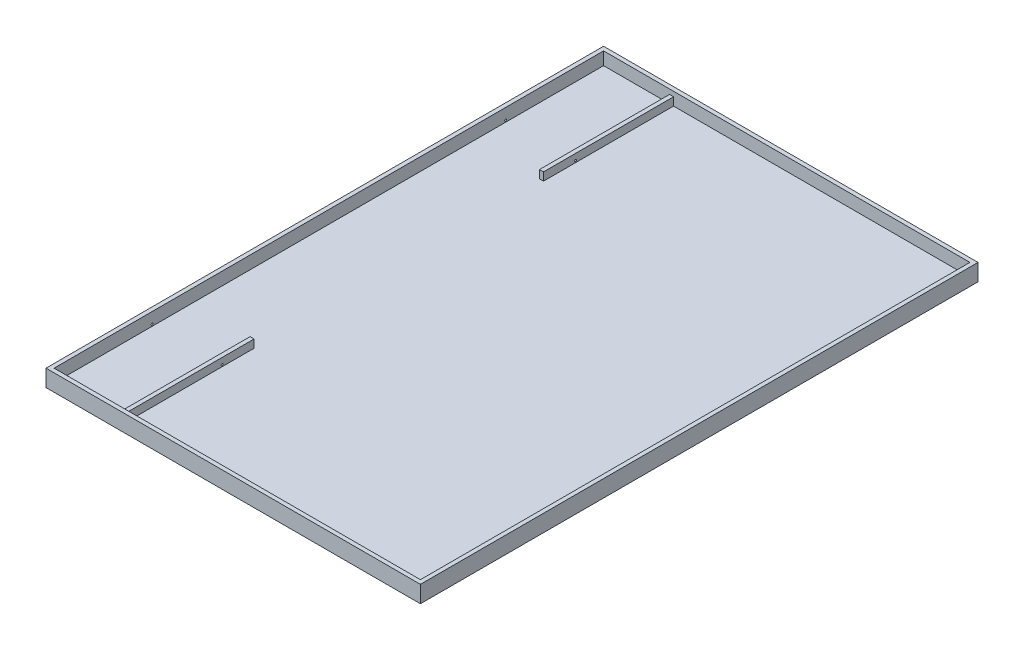
ISO-10303-21;
HEADER;
FILE_DESCRIPTION(('STEP AP214'),'2;1');
FILE_NAME('part.step','',(''),(''),'','','');
FILE_SCHEMA(('AUTOMOTIVE_DESIGN { 1 0 10303 214 1 1 1 1 }'));
ENDSEC;
DATA;
#1=APPLICATION_CONTEXT('core data for automotive mechanical design processes');
#2=APPLICATION_PROTOCOL_DEFINITION('international standard','automotive_design',2000,#1);
#3=PRODUCT_CONTEXT('',#1,'mechanical');
#4=PRODUCT('Part','Part','',(#3));
#5=PRODUCT_RELATED_PRODUCT_CATEGORY('part','',(#4));
#6=PRODUCT_DEFINITION_FORMATION('','',#4);
#7=PRODUCT_DEFINITION_CONTEXT('part definition',#1,'design');
#8=PRODUCT_DEFINITION('design','',#6,#7);
#9=PRODUCT_DEFINITION_SHAPE('','',#8);
#10=(LENGTH_UNIT() NAMED_UNIT(*) SI_UNIT(.MILLI.,.METRE.));
#11=(NAMED_UNIT(*) PLANE_ANGLE_UNIT() SI_UNIT($,.RADIAN.));
#12=(NAMED_UNIT(*) SI_UNIT($,.STERADIAN.) SOLID_ANGLE_UNIT());
#13=UNCERTAINTY_MEASURE_WITH_UNIT(LENGTH_MEASURE(1.E-05),#10,'distance_accuracy_value','');
#14=(GEOMETRIC_REPRESENTATION_CONTEXT(3) GLOBAL_UNCERTAINTY_ASSIGNED_CONTEXT((#13)) GLOBAL_UNIT_ASSIGNED_CONTEXT((#10,
#11,#12)) REPRESENTATION_CONTEXT('',''));
#15=CARTESIAN_POINT('',(0.,0.,0.));
#16=DIRECTION('',(0.,0.,1.));
#17=DIRECTION('',(1.,0.,0.));
#18=AXIS2_PLACEMENT_3D('',#15,#16,#17);
#19=CARTESIAN_POINT('',(1000.,-3688.58860522966,-1500.));
#20=DIRECTION('',(0.,0.,-1.));
#21=DIRECTION('',(-1.,0.,0.));
#22=AXIS2_PLACEMENT_3D('',#19,#20,#21);
#23=PLANE('',#22);
#24=DIRECTION('',(0.,-1.,0.));
#25=VECTOR('',#24,1.);
#26=CARTESIAN_POINT('',(-640.,44.,-1500.));
#27=LINE('',#26,#25);
#28=CARTESIAN_POINT('',(-640.,44.,-1500.));
#29=VERTEX_POINT('',#28);
#30=CARTESIAN_POINT('',(-640.,0.,-1500.));
#31=VERTEX_POINT('',#30);
#32=EDGE_CURVE('E199',#29,#31,#27,.T.);
#33=ORIENTED_EDGE('',*,*,#32,.F.);
#34=DIRECTION('',(-1.,0.,0.));
#35=VECTOR('',#34,1.);
#36=CARTESIAN_POINT('',(-640.,44.,-1500.));
#37=LINE('',#36,#35);
#38=CARTESIAN_POINT('',(-618.,44.,-1500.));
#39=VERTEX_POINT('',#38);
#40=EDGE_CURVE('E197',#39,#29,#37,.T.);
#41=ORIENTED_EDGE('',*,*,#40,.F.);
#42=DIRECTION('',(0.,-1.,0.));
#43=VECTOR('',#42,1.);
#44=CARTESIAN_POINT('',(-618.,44.,-1500.));
#45=LINE('',#44,#43);
#46=CARTESIAN_POINT('',(-618.,0.,-1500.));
#47=VERTEX_POINT('',#46);
#48=EDGE_CURVE('E206',#39,#47,#45,.T.);
#49=ORIENTED_EDGE('',*,*,#48,.T.);
#50=DIRECTION('',(-1.,0.,0.));
#51=VECTOR('',#50,1.);
#52=CARTESIAN_POINT('',(-1000.,0.,-1500.));
#53=LINE('',#52,#51);
#54=CARTESIAN_POINT('',(1000.,0.,-1500.));
#55=VERTEX_POINT('',#54);
#56=EDGE_CURVE('E11',#55,#47,#53,.T.);
#57=ORIENTED_EDGE('',*,*,#56,.F.);
#58=DIRECTION('',(0.,1.,0.));
#59=VECTOR('',#58,1.);
#60=CARTESIAN_POINT('',(1000.,-3688.58860522966,-1500.));
#61=LINE('',#60,#59);
#62=CARTESIAN_POINT('',(1000.,70.,-1500.));
#63=VERTEX_POINT('',#62);
#64=EDGE_CURVE('E247',#55,#63,#61,.T.);
#65=ORIENTED_EDGE('',*,*,#64,.T.);
#66=DIRECTION('',(-1.,0.,0.));
#67=VECTOR('',#66,1.);
#68=CARTESIAN_POINT('',(1000.,70.,-1500.));
#69=LINE('',#68,#67);
#70=CARTESIAN_POINT('',(-1000.,70.,-1500.));
#71=VERTEX_POINT('',#70);
#72=EDGE_CURVE('E212',#63,#71,#69,.T.);
#73=ORIENTED_EDGE('',*,*,#72,.T.);
#74=DIRECTION('',(0.,1.,0.));
#75=VECTOR('',#74,1.);
#76=CARTESIAN_POINT('',(-1000.,-3688.58860522966,-1500.));
#77=LINE('',#76,#75);
#78=CARTESIAN_POINT('',(-1000.,0.,-1500.));
#79=VERTEX_POINT('',#78);
#80=EDGE_CURVE('E236',#79,#71,#77,.T.);
#81=ORIENTED_EDGE('',*,*,#80,.F.);
#82=EDGE_CURVE('E42',#31,#79,#53,.T.);
#83=ORIENTED_EDGE('',*,*,#82,.F.);
#84=EDGE_LOOP('',(#33,#41,#49,#57,#65,#73,#81,#83));
#85=FACE_BOUND('',#84,.T.);
#86=ADVANCED_FACE('F34',(#85),#23,.F.);
#87=CARTESIAN_POINT('',(0.,0.,0.));
#88=DIRECTION('',(0.,1.,0.));
#89=DIRECTION('',(0.,0.,1.));
#90=AXIS2_PLACEMENT_3D('',#87,#88,#89);
#91=PLANE('',#90);
#92=DIRECTION('',(0.,0.,-1.));
#93=VECTOR('',#92,1.);
#94=CARTESIAN_POINT('',(-640.,0.,1500.));
#95=LINE('',#94,#93);
#96=CARTESIAN_POINT('',(-640.,0.,1500.));
#97=VERTEX_POINT('',#96);
#98=CARTESIAN_POINT('',(-640.,0.,790.));
#99=VERTEX_POINT('',#98);
#100=EDGE_CURVE('E285',#97,#99,#95,.T.);
#101=ORIENTED_EDGE('',*,*,#100,.T.);
#102=DIRECTION('',(1.,0.,0.));
#103=VECTOR('',#102,1.);
#104=CARTESIAN_POINT('',(-640.,0.,790.));
#105=LINE('',#104,#103);
#106=CARTESIAN_POINT('',(-618.,0.,790.));
#107=VERTEX_POINT('',#106);
#108=EDGE_CURVE('E287',#99,#107,#105,.T.);
#109=ORIENTED_EDGE('',*,*,#108,.T.);
#110=DIRECTION('',(0.,0.,1.));
#111=VECTOR('',#110,1.);
#112=CARTESIAN_POINT('',(-618.,0.,1500.));
#113=LINE('',#112,#111);
#114=CARTESIAN_POINT('',(-618.,0.,1500.));
#115=VERTEX_POINT('',#114);
#116=EDGE_CURVE('E289',#107,#115,#113,.T.);
#117=ORIENTED_EDGE('',*,*,#116,.T.);
#118=DIRECTION('',(1.,0.,0.));
#119=VECTOR('',#118,1.);
#120=CARTESIAN_POINT('',(-1000.,0.,1500.));
#121=LINE('',#120,#119);
#122=CARTESIAN_POINT('',(1000.,0.,1500.));
#123=VERTEX_POINT('',#122);
#124=EDGE_CURVE('E168',#115,#123,#121,.T.);
#125=ORIENTED_EDGE('',*,*,#124,.T.);
#126=DIRECTION('',(0.,0.,-1.));
#127=VECTOR('',#126,1.);
#128=CARTESIAN_POINT('',(1000.,0.,-1500.));
#129=LINE('',#128,#127);
#130=EDGE_CURVE('E265',#123,#55,#129,.T.);
#131=ORIENTED_EDGE('',*,*,#130,.T.);
#132=ORIENTED_EDGE('',*,*,#56,.T.);
#133=DIRECTION('',(0.,0.,-1.));
#134=VECTOR('',#133,1.);
#135=CARTESIAN_POINT('',(-618.,0.,-1500.));
#136=LINE('',#135,#134);
#137=CARTESIAN_POINT('',(-618.,0.,-790.));
#138=VERTEX_POINT('',#137);
#139=EDGE_CURVE('E193',#138,#47,#136,.T.);
#140=ORIENTED_EDGE('',*,*,#139,.F.);
#141=DIRECTION('',(1.,0.,0.));
#142=VECTOR('',#141,1.);
#143=CARTESIAN_POINT('',(-640.,0.,-790.));
#144=LINE('',#143,#142);
#145=CARTESIAN_POINT('',(-640.,0.,-790.));
#146=VERTEX_POINT('',#145);
#147=EDGE_CURVE('E202',#146,#138,#144,.T.);
#148=ORIENTED_EDGE('',*,*,#147,.F.);
#149=DIRECTION('',(0.,0.,1.));
#150=VECTOR('',#149,1.);
#151=CARTESIAN_POINT('',(-640.,0.,-1500.));
#152=LINE('',#151,#150);
#153=EDGE_CURVE('E188',#31,#146,#152,.T.);
#154=ORIENTED_EDGE('',*,*,#153,.F.);
#155=ORIENTED_EDGE('',*,*,#82,.T.);
#156=DIRECTION('',(0.,0.,1.));
#157=VECTOR('',#156,1.);
#158=CARTESIAN_POINT('',(-1000.,0.,-1500.));
#159=LINE('',#158,#157);
#160=CARTESIAN_POINT('',(-1000.,0.,1500.));
#161=VERTEX_POINT('',#160);
#162=EDGE_CURVE('E239',#79,#161,#159,.T.);
#163=ORIENTED_EDGE('',*,*,#162,.T.);
#164=EDGE_CURVE('E263',#161,#97,#121,.T.);
#165=ORIENTED_EDGE('',*,*,#164,.T.);
#166=EDGE_LOOP('',(#101,#109,#117,#125,#131,#132,#140,#148,#154,#155,#163,#165));
#167=FACE_BOUND('',#166,.T.);
#168=ADVANCED_FACE('F36',(#167),#91,.T.);
#169=CARTESIAN_POINT('',(0.,-22.,0.));
#170=DIRECTION('',(0.,1.,0.));
#171=DIRECTION('',(0.,0.,1.));
#172=AXIS2_PLACEMENT_3D('',#169,#170,#171);
#173=PLANE('',#172);
#174=DIRECTION('',(1.,0.,0.));
#175=VECTOR('',#174,1.);
#176=CARTESIAN_POINT('',(1022.,-21.9999999999998,-1522.));
#177=LINE('',#176,#175);
#178=CARTESIAN_POINT('',(-1022.,-21.9999999999998,-1522.));
#179=VERTEX_POINT('',#178);
#180=CARTESIAN_POINT('',(1022.,-21.9999999999998,-1522.));
#181=VERTEX_POINT('',#180);
#182=EDGE_CURVE('E240',#179,#181,#177,.T.);
#183=ORIENTED_EDGE('',*,*,#182,.T.);
#184=DIRECTION('',(0.,0.,1.));
#185=VECTOR('',#184,1.);
#186=CARTESIAN_POINT('',(1022.,-21.9999999999998,1522.));
#187=LINE('',#186,#185);
#188=CARTESIAN_POINT('',(1022.,-21.9999999999998,1522.));
#189=VERTEX_POINT('',#188);
#190=EDGE_CURVE('E243',#181,#189,#187,.T.);
#191=ORIENTED_EDGE('',*,*,#190,.T.);
#192=DIRECTION('',(-1.,0.,0.));
#193=VECTOR('',#192,1.);
#194=CARTESIAN_POINT('',(-1022.,-21.9999999999998,1522.));
#195=LINE('',#194,#193);
#196=CARTESIAN_POINT('',(-1022.,-21.9999999999998,1522.));
#197=VERTEX_POINT('',#196);
#198=EDGE_CURVE('E241',#189,#197,#195,.T.);
#199=ORIENTED_EDGE('',*,*,#198,.T.);
#200=DIRECTION('',(0.,0.,-1.));
#201=VECTOR('',#200,1.);
#202=CARTESIAN_POINT('',(-1022.,-21.9999999999998,-1522.));
#203=LINE('',#202,#201);
#204=EDGE_CURVE('E237',#197,#179,#203,.T.);
#205=ORIENTED_EDGE('',*,*,#204,.T.);
#206=EDGE_LOOP('',(#183,#191,#199,#205));
#207=FACE_BOUND('',#206,.T.);
#208=ADVANCED_FACE('F319',(#207),#173,.F.);
#209=CARTESIAN_POINT('',(-1022.,-3688.58860522966,-1522.));
#210=DIRECTION('',(-1.,0.,0.));
#211=DIRECTION('',(0.,0.,1.));
#212=AXIS2_PLACEMENT_3D('',#209,#210,#211);
#213=PLANE('',#212);
#214=CARTESIAN_POINT('',(-1022.,10.,965.));
#215=DIRECTION('',(-1.,0.,0.));
#216=DIRECTION('',(0.,0.,1.));
#217=AXIS2_PLACEMENT_3D('',#214,#215,#216);
#218=CIRCLE('',#217,5.00000000000004);
#219=CARTESIAN_POINT('',(-1022.,10.,970.));
#220=VERTEX_POINT('',#219);
#221=EDGE_CURVE('E305',#220,#220,#218,.T.);
#222=ORIENTED_EDGE('',*,*,#221,.F.);
#223=EDGE_LOOP('',(#222));
#224=FACE_BOUND('',#223,.T.);
#225=CARTESIAN_POINT('',(-1022.,10.,-965.));
#226=DIRECTION('',(1.,0.,0.));
#227=DIRECTION('',(0.,0.,-1.));
#228=AXIS2_PLACEMENT_3D('',#225,#226,#227);
#229=CIRCLE('',#228,5.00000000000004);
#230=CARTESIAN_POINT('',(-1022.,10.,-970.));
#231=VERTEX_POINT('',#230);
#232=EDGE_CURVE('E177',#231,#231,#229,.T.);
#233=ORIENTED_EDGE('',*,*,#232,.T.);
#234=EDGE_LOOP('',(#233));
#235=FACE_BOUND('',#234,.T.);
#236=ORIENTED_EDGE('',*,*,#204,.F.);
#237=DIRECTION('',(0.,1.,0.));
#238=VECTOR('',#237,1.);
#239=CARTESIAN_POINT('',(-1022.,-3688.58860522966,1522.));
#240=LINE('',#239,#238);
#241=CARTESIAN_POINT('',(-1022.,70.,1522.));
#242=VERTEX_POINT('',#241);
#243=EDGE_CURVE('E258',#197,#242,#240,.T.);
#244=ORIENTED_EDGE('',*,*,#243,.T.);
#245=DIRECTION('',(0.,0.,1.));
#246=VECTOR('',#245,1.);
#247=CARTESIAN_POINT('',(-1022.,70.,-1522.));
#248=LINE('',#247,#246);
#249=CARTESIAN_POINT('',(-1022.,70.,-1522.));
#250=VERTEX_POINT('',#249);
#251=EDGE_CURVE('E227',#250,#242,#248,.T.);
#252=ORIENTED_EDGE('',*,*,#251,.F.);
#253=DIRECTION('',(0.,1.,0.));
#254=VECTOR('',#253,1.);
#255=CARTESIAN_POINT('',(-1022.,-3688.58860522966,-1522.));
#256=LINE('',#255,#254);
#257=EDGE_CURVE('E249',#179,#250,#256,.T.);
#258=ORIENTED_EDGE('',*,*,#257,.F.);
#259=EDGE_LOOP('',(#236,#244,#252,#258));
#260=FACE_BOUND('',#259,.T.);
#261=ADVANCED_FACE('F315',(#224,#235,#260),#213,.T.);
#262=CARTESIAN_POINT('',(-1022.,-3688.58860522966,1522.));
#263=DIRECTION('',(0.,0.,1.));
#264=DIRECTION('',(1.,0.,0.));
#265=AXIS2_PLACEMENT_3D('',#262,#263,#264);
#266=PLANE('',#265);
#267=ORIENTED_EDGE('',*,*,#198,.F.);
#268=DIRECTION('',(0.,1.,0.));
#269=VECTOR('',#268,1.);
#270=CARTESIAN_POINT('',(1022.,-3688.58860522966,1522.));
#271=LINE('',#270,#269);
#272=CARTESIAN_POINT('',(1022.,70.,1522.));
#273=VERTEX_POINT('',#272);
#274=EDGE_CURVE('E256',#189,#273,#271,.T.);
#275=ORIENTED_EDGE('',*,*,#274,.T.);
#276=DIRECTION('',(1.,0.,0.));
#277=VECTOR('',#276,1.);
#278=CARTESIAN_POINT('',(-1022.,70.,1522.));
#279=LINE('',#278,#277);
#280=EDGE_CURVE('E230',#242,#273,#279,.T.);
#281=ORIENTED_EDGE('',*,*,#280,.F.);
#282=ORIENTED_EDGE('',*,*,#243,.F.);
#283=EDGE_LOOP('',(#267,#275,#281,#282));
#284=FACE_BOUND('',#283,.T.);
#285=ADVANCED_FACE('F318',(#284),#266,.T.);
#286=CARTESIAN_POINT('',(1022.,-3688.58860522966,1522.));
#287=DIRECTION('',(1.,0.,0.));
#288=DIRECTION('',(0.,0.,-1.));
#289=AXIS2_PLACEMENT_3D('',#286,#287,#288);
#290=PLANE('',#289);
#291=ORIENTED_EDGE('',*,*,#190,.F.);
#292=DIRECTION('',(0.,1.,0.));
#293=VECTOR('',#292,1.);
#294=CARTESIAN_POINT('',(1022.,-3688.58860522966,-1522.));
#295=LINE('',#294,#293);
#296=CARTESIAN_POINT('',(1022.,70.,-1522.));
#297=VERTEX_POINT('',#296);
#298=EDGE_CURVE('E244',#181,#297,#295,.T.);
#299=ORIENTED_EDGE('',*,*,#298,.T.);
#300=DIRECTION('',(0.,0.,-1.));
#301=VECTOR('',#300,1.);
#302=CARTESIAN_POINT('',(1022.,70.,1522.));
#303=LINE('',#302,#301);
#304=EDGE_CURVE('E233',#273,#297,#303,.T.);
#305=ORIENTED_EDGE('',*,*,#304,.F.);
#306=ORIENTED_EDGE('',*,*,#274,.F.);
#307=EDGE_LOOP('',(#291,#299,#305,#306));
#308=FACE_BOUND('',#307,.T.);
#309=ADVANCED_FACE('F337',(#308),#290,.T.);
#310=CARTESIAN_POINT('',(1022.,-3688.58860522966,-1522.));
#311=DIRECTION('',(0.,0.,-1.));
#312=DIRECTION('',(-1.,0.,0.));
#313=AXIS2_PLACEMENT_3D('',#310,#311,#312);
#314=PLANE('',#313);
#315=ORIENTED_EDGE('',*,*,#182,.F.);
#316=ORIENTED_EDGE('',*,*,#257,.T.);
#317=DIRECTION('',(-1.,0.,0.));
#318=VECTOR('',#317,1.);
#319=CARTESIAN_POINT('',(1022.,70.,-1522.));
#320=LINE('',#319,#318);
#321=EDGE_CURVE('E224',#297,#250,#320,.T.);
#322=ORIENTED_EDGE('',*,*,#321,.F.);
#323=ORIENTED_EDGE('',*,*,#298,.F.);
#324=EDGE_LOOP('',(#315,#316,#322,#323));
#325=FACE_BOUND('',#324,.T.);
#326=ADVANCED_FACE('F333',(#325),#314,.T.);
#327=CARTESIAN_POINT('',(-1000.,-3688.58860522966,-1500.));
#328=DIRECTION('',(-1.,0.,0.));
#329=DIRECTION('',(0.,0.,1.));
#330=AXIS2_PLACEMENT_3D('',#327,#328,#329);
#331=PLANE('',#330);
#332=CARTESIAN_POINT('',(-1000.,10.,965.));
#333=DIRECTION('',(-1.,0.,0.));
#334=DIRECTION('',(0.,0.,1.));
#335=AXIS2_PLACEMENT_3D('',#332,#333,#334);
#336=CIRCLE('',#335,5.00000000000004);
#337=CARTESIAN_POINT('',(-1000.,10.,970.));
#338=VERTEX_POINT('',#337);
#339=EDGE_CURVE('E290',#338,#338,#336,.F.);
#340=ORIENTED_EDGE('',*,*,#339,.F.);
#341=EDGE_LOOP('',(#340));
#342=FACE_BOUND('',#341,.T.);
#343=CARTESIAN_POINT('',(-1000.,10.,-965.));
#344=DIRECTION('',(-1.,0.,0.));
#345=DIRECTION('',(0.,0.,1.));
#346=AXIS2_PLACEMENT_3D('',#343,#344,#345);
#347=CIRCLE('',#346,5.00000000000004);
#348=CARTESIAN_POINT('',(-1000.,10.,-960.));
#349=VERTEX_POINT('',#348);
#350=EDGE_CURVE('E185',#349,#349,#347,.T.);
#351=ORIENTED_EDGE('',*,*,#350,.T.);
#352=EDGE_LOOP('',(#351));
#353=FACE_BOUND('',#352,.T.);
#354=ORIENTED_EDGE('',*,*,#162,.F.);
#355=ORIENTED_EDGE('',*,*,#80,.T.);
#356=DIRECTION('',(0.,0.,1.));
#357=VECTOR('',#356,1.);
#358=CARTESIAN_POINT('',(-1000.,70.,-1500.));
#359=LINE('',#358,#357);
#360=CARTESIAN_POINT('',(-1000.,70.,1500.));
#361=VERTEX_POINT('',#360);
#362=EDGE_CURVE('E215',#71,#361,#359,.T.);
#363=ORIENTED_EDGE('',*,*,#362,.T.);
#364=DIRECTION('',(0.,1.,0.));
#365=VECTOR('',#364,1.);
#366=CARTESIAN_POINT('',(-1000.,-3688.58860522966,1500.));
#367=LINE('',#366,#365);
#368=EDGE_CURVE('E252',#161,#361,#367,.T.);
#369=ORIENTED_EDGE('',*,*,#368,.F.);
#370=EDGE_LOOP('',(#354,#355,#363,#369));
#371=FACE_BOUND('',#370,.T.);
#372=ADVANCED_FACE('F281',(#342,#353,#371),#331,.F.);
#373=CARTESIAN_POINT('',(-1000.,-3688.58860522966,1500.));
#374=DIRECTION('',(0.,0.,1.));
#375=DIRECTION('',(1.,0.,0.));
#376=AXIS2_PLACEMENT_3D('',#373,#374,#375);
#377=PLANE('',#376);
#378=DIRECTION('',(-1.,0.,0.));
#379=VECTOR('',#378,1.);
#380=CARTESIAN_POINT('',(-640.,44.,1500.));
#381=LINE('',#380,#379);
#382=CARTESIAN_POINT('',(-618.,44.,1500.));
#383=VERTEX_POINT('',#382);
#384=CARTESIAN_POINT('',(-640.,44.,1500.));
#385=VERTEX_POINT('',#384);
#386=EDGE_CURVE('E148',#383,#385,#381,.T.);
#387=ORIENTED_EDGE('',*,*,#386,.T.);
#388=DIRECTION('',(0.,-1.,0.));
#389=VECTOR('',#388,1.);
#390=CARTESIAN_POINT('',(-640.,44.,1500.));
#391=LINE('',#390,#389);
#392=EDGE_CURVE('E169',#385,#97,#391,.T.);
#393=ORIENTED_EDGE('',*,*,#392,.T.);
#394=ORIENTED_EDGE('',*,*,#164,.F.);
#395=ORIENTED_EDGE('',*,*,#368,.T.);
#396=DIRECTION('',(1.,0.,0.));
#397=VECTOR('',#396,1.);
#398=CARTESIAN_POINT('',(-1000.,70.,1500.));
#399=LINE('',#398,#397);
#400=CARTESIAN_POINT('',(1000.,70.,1500.));
#401=VERTEX_POINT('',#400);
#402=EDGE_CURVE('E218',#361,#401,#399,.T.);
#403=ORIENTED_EDGE('',*,*,#402,.T.);
#404=DIRECTION('',(0.,1.,0.));
#405=VECTOR('',#404,1.);
#406=CARTESIAN_POINT('',(1000.,-3688.58860522966,1500.));
#407=LINE('',#406,#405);
#408=EDGE_CURVE('E250',#123,#401,#407,.T.);
#409=ORIENTED_EDGE('',*,*,#408,.F.);
#410=ORIENTED_EDGE('',*,*,#124,.F.);
#411=DIRECTION('',(0.,-1.,0.));
#412=VECTOR('',#411,1.);
#413=CARTESIAN_POINT('',(-618.,44.,1500.));
#414=LINE('',#413,#412);
#415=EDGE_CURVE('E160',#383,#115,#414,.T.);
#416=ORIENTED_EDGE('',*,*,#415,.F.);
#417=EDGE_LOOP('',(#387,#393,#394,#395,#403,#409,#410,#416));
#418=FACE_BOUND('',#417,.T.);
#419=ADVANCED_FACE('F166',(#418),#377,.F.);
#420=CARTESIAN_POINT('',(1000.,-3688.58860522966,1500.));
#421=DIRECTION('',(1.,0.,0.));
#422=DIRECTION('',(0.,0.,-1.));
#423=AXIS2_PLACEMENT_3D('',#420,#421,#422);
#424=PLANE('',#423);
#425=ORIENTED_EDGE('',*,*,#130,.F.);
#426=ORIENTED_EDGE('',*,*,#408,.T.);
#427=DIRECTION('',(0.,0.,-1.));
#428=VECTOR('',#427,1.);
#429=CARTESIAN_POINT('',(1000.,70.,1500.));
#430=LINE('',#429,#428);
#431=EDGE_CURVE('E221',#401,#63,#430,.T.);
#432=ORIENTED_EDGE('',*,*,#431,.T.);
#433=ORIENTED_EDGE('',*,*,#64,.F.);
#434=EDGE_LOOP('',(#425,#426,#432,#433));
#435=FACE_BOUND('',#434,.T.);
#436=ADVANCED_FACE('F361',(#435),#424,.F.);
#437=CARTESIAN_POINT('',(0.,70.,0.));
#438=DIRECTION('',(0.,1.,0.));
#439=DIRECTION('',(0.,0.,1.));
#440=AXIS2_PLACEMENT_3D('',#437,#438,#439);
#441=PLANE('',#440);
#442=ORIENTED_EDGE('',*,*,#321,.T.);
#443=ORIENTED_EDGE('',*,*,#251,.T.);
#444=ORIENTED_EDGE('',*,*,#280,.T.);
#445=ORIENTED_EDGE('',*,*,#304,.T.);
#446=EDGE_LOOP('',(#442,#443,#444,#445));
#447=FACE_BOUND('',#446,.T.);
#448=ORIENTED_EDGE('',*,*,#362,.F.);
#449=ORIENTED_EDGE('',*,*,#72,.F.);
#450=ORIENTED_EDGE('',*,*,#431,.F.);
#451=ORIENTED_EDGE('',*,*,#402,.F.);
#452=EDGE_LOOP('',(#448,#449,#450,#451));
#453=FACE_BOUND('',#452,.T.);
#454=ADVANCED_FACE('F340',(#447,#453),#441,.T.);
#455=CARTESIAN_POINT('',(-640.,44.,-1500.));
#456=DIRECTION('',(1.,0.,0.));
#457=DIRECTION('',(0.,0.,-1.));
#458=AXIS2_PLACEMENT_3D('',#455,#456,#457);
#459=PLANE('',#458);
#460=CARTESIAN_POINT('',(-640.,10.,-965.));
#461=DIRECTION('',(1.,0.,0.));
#462=DIRECTION('',(0.,0.,-1.));
#463=AXIS2_PLACEMENT_3D('',#460,#461,#462);
#464=CIRCLE('',#463,5.00000000000004);
#465=CARTESIAN_POINT('',(-640.,10.,-970.));
#466=VERTEX_POINT('',#465);
#467=EDGE_CURVE('E180',#466,#466,#464,.T.);
#468=ORIENTED_EDGE('',*,*,#467,.T.);
#469=EDGE_LOOP('',(#468));
#470=FACE_BOUND('',#469,.T.);
#471=ORIENTED_EDGE('',*,*,#153,.T.);
#472=DIRECTION('',(0.,-1.,0.));
#473=VECTOR('',#472,1.);
#474=CARTESIAN_POINT('',(-640.,44.,-790.));
#475=LINE('',#474,#473);
#476=CARTESIAN_POINT('',(-640.,44.,-790.));
#477=VERTEX_POINT('',#476);
#478=EDGE_CURVE('E210',#477,#146,#475,.T.);
#479=ORIENTED_EDGE('',*,*,#478,.F.);
#480=DIRECTION('',(0.,0.,1.));
#481=VECTOR('',#480,1.);
#482=CARTESIAN_POINT('',(-640.,44.,-1500.));
#483=LINE('',#482,#481);
#484=EDGE_CURVE('E189',#29,#477,#483,.T.);
#485=ORIENTED_EDGE('',*,*,#484,.F.);
#486=ORIENTED_EDGE('',*,*,#32,.T.);
#487=EDGE_LOOP('',(#471,#479,#485,#486));
#488=FACE_BOUND('',#487,.T.);
#489=ADVANCED_FACE('F367',(#470,#488),#459,.F.);
#490=CARTESIAN_POINT('',(-640.,44.,-790.));
#491=DIRECTION('',(0.,0.,-1.));
#492=DIRECTION('',(-1.,0.,0.));
#493=AXIS2_PLACEMENT_3D('',#490,#491,#492);
#494=PLANE('',#493);
#495=ORIENTED_EDGE('',*,*,#147,.T.);
#496=DIRECTION('',(0.,-1.,0.));
#497=VECTOR('',#496,1.);
#498=CARTESIAN_POINT('',(-618.,44.,-790.));
#499=LINE('',#498,#497);
#500=CARTESIAN_POINT('',(-618.,44.,-790.));
#501=VERTEX_POINT('',#500);
#502=EDGE_CURVE('E57',#501,#138,#499,.T.);
#503=ORIENTED_EDGE('',*,*,#502,.F.);
#504=DIRECTION('',(1.,0.,0.));
#505=VECTOR('',#504,1.);
#506=CARTESIAN_POINT('',(-640.,44.,-790.));
#507=LINE('',#506,#505);
#508=EDGE_CURVE('E192',#477,#501,#507,.T.);
#509=ORIENTED_EDGE('',*,*,#508,.F.);
#510=ORIENTED_EDGE('',*,*,#478,.T.);
#511=EDGE_LOOP('',(#495,#503,#509,#510));
#512=FACE_BOUND('',#511,.T.);
#513=ADVANCED_FACE('F370',(#512),#494,.F.);
#514=CARTESIAN_POINT('',(-618.,44.,-1500.));
#515=DIRECTION('',(-1.,0.,0.));
#516=DIRECTION('',(0.,0.,1.));
#517=AXIS2_PLACEMENT_3D('',#514,#515,#516);
#518=PLANE('',#517);
#519=CARTESIAN_POINT('',(-618.,10.,-965.));
#520=DIRECTION('',(1.,0.,0.));
#521=DIRECTION('',(0.,0.,-1.));
#522=AXIS2_PLACEMENT_3D('',#519,#520,#521);
#523=CIRCLE('',#522,5.00000000000004);
#524=CARTESIAN_POINT('',(-618.,10.,-970.));
#525=VERTEX_POINT('',#524);
#526=EDGE_CURVE('E171',#525,#525,#523,.T.);
#527=ORIENTED_EDGE('',*,*,#526,.F.);
#528=EDGE_LOOP('',(#527));
#529=FACE_BOUND('',#528,.T.);
#530=ORIENTED_EDGE('',*,*,#139,.T.);
#531=ORIENTED_EDGE('',*,*,#48,.F.);
#532=DIRECTION('',(0.,0.,-1.));
#533=VECTOR('',#532,1.);
#534=CARTESIAN_POINT('',(-618.,44.,-1500.));
#535=LINE('',#534,#533);
#536=EDGE_CURVE('E195',#501,#39,#535,.T.);
#537=ORIENTED_EDGE('',*,*,#536,.F.);
#538=ORIENTED_EDGE('',*,*,#502,.T.);
#539=EDGE_LOOP('',(#530,#531,#537,#538));
#540=FACE_BOUND('',#539,.T.);
#541=ADVANCED_FACE('F374',(#529,#540),#518,.F.);
#542=CARTESIAN_POINT('',(0.,44.,0.));
#543=DIRECTION('',(0.,1.,0.));
#544=DIRECTION('',(0.,0.,1.));
#545=AXIS2_PLACEMENT_3D('',#542,#543,#544);
#546=PLANE('',#545);
#547=ORIENTED_EDGE('',*,*,#484,.T.);
#548=ORIENTED_EDGE('',*,*,#508,.T.);
#549=ORIENTED_EDGE('',*,*,#536,.T.);
#550=ORIENTED_EDGE('',*,*,#40,.T.);
#551=EDGE_LOOP('',(#547,#548,#549,#550));
#552=FACE_BOUND('',#551,.T.);
#553=ADVANCED_FACE('F378',(#552),#546,.T.);
#554=CARTESIAN_POINT('',(-1022.,10.,-965.));
#555=DIRECTION('',(1.,0.,0.));
#556=DIRECTION('',(0.,0.,-1.));
#557=AXIS2_PLACEMENT_3D('',#554,#555,#556);
#558=CYLINDRICAL_SURFACE('',#557,5.00000000000004);
#559=ORIENTED_EDGE('',*,*,#526,.T.);
#560=EDGE_LOOP('',(#559));
#561=FACE_BOUND('',#560,.T.);
#562=ORIENTED_EDGE('',*,*,#467,.F.);
#563=EDGE_LOOP('',(#562));
#564=FACE_BOUND('',#563,.T.);
#565=ADVANCED_FACE('F382',(#561,#564),#558,.F.);
#566=ORIENTED_EDGE('',*,*,#232,.F.);
#567=EDGE_LOOP('',(#566));
#568=FACE_BOUND('',#567,.T.);
#569=ORIENTED_EDGE('',*,*,#350,.F.);
#570=EDGE_LOOP('',(#569));
#571=FACE_BOUND('',#570,.T.);
#572=ADVANCED_FACE('F384',(#568,#571),#558,.F.);
#573=CARTESIAN_POINT('',(-640.,44.,1500.));
#574=DIRECTION('',(-1.,0.,0.));
#575=DIRECTION('',(0.,0.,1.));
#576=AXIS2_PLACEMENT_3D('',#573,#574,#575);
#577=PLANE('',#576);
#578=CARTESIAN_POINT('',(-640.,10.,965.));
#579=DIRECTION('',(-1.,0.,0.));
#580=DIRECTION('',(0.,0.,1.));
#581=AXIS2_PLACEMENT_3D('',#578,#579,#580);
#582=CIRCLE('',#581,5.00000000000004);
#583=CARTESIAN_POINT('',(-640.,10.,970.));
#584=VERTEX_POINT('',#583);
#585=EDGE_CURVE('E294',#584,#584,#582,.F.);
#586=ORIENTED_EDGE('',*,*,#585,.T.);
#587=EDGE_LOOP('',(#586));
#588=FACE_BOUND('',#587,.T.);
#589=ORIENTED_EDGE('',*,*,#100,.F.);
#590=ORIENTED_EDGE('',*,*,#392,.F.);
#591=DIRECTION('',(0.,0.,-1.));
#592=VECTOR('',#591,1.);
#593=CARTESIAN_POINT('',(-640.,44.,1500.));
#594=LINE('',#593,#592);
#595=CARTESIAN_POINT('',(-640.,44.,790.));
#596=VERTEX_POINT('',#595);
#597=EDGE_CURVE('E49',#385,#596,#594,.T.);
#598=ORIENTED_EDGE('',*,*,#597,.T.);
#599=DIRECTION('',(0.,-1.,0.));
#600=VECTOR('',#599,1.);
#601=CARTESIAN_POINT('',(-640.,44.,790.));
#602=LINE('',#601,#600);
#603=EDGE_CURVE('E173',#596,#99,#602,.T.);
#604=ORIENTED_EDGE('',*,*,#603,.T.);
#605=EDGE_LOOP('',(#589,#590,#598,#604));
#606=FACE_BOUND('',#605,.T.);
#607=ADVANCED_FACE('F300',(#588,#606),#577,.T.);
#608=CARTESIAN_POINT('',(-618.,44.,1500.));
#609=DIRECTION('',(1.,0.,0.));
#610=DIRECTION('',(0.,0.,-1.));
#611=AXIS2_PLACEMENT_3D('',#608,#609,#610);
#612=PLANE('',#611);
#613=CARTESIAN_POINT('',(-618.,10.,965.));
#614=DIRECTION('',(-1.,0.,0.));
#615=DIRECTION('',(0.,0.,1.));
#616=AXIS2_PLACEMENT_3D('',#613,#614,#615);
#617=CIRCLE('',#616,5.00000000000004);
#618=CARTESIAN_POINT('',(-618.,10.,970.));
#619=VERTEX_POINT('',#618);
#620=EDGE_CURVE('E306',#619,#619,#617,.T.);
#621=ORIENTED_EDGE('',*,*,#620,.T.);
#622=EDGE_LOOP('',(#621));
#623=FACE_BOUND('',#622,.T.);
#624=ORIENTED_EDGE('',*,*,#116,.F.);
#625=DIRECTION('',(0.,-1.,0.));
#626=VECTOR('',#625,1.);
#627=CARTESIAN_POINT('',(-618.,44.,790.));
#628=LINE('',#627,#626);
#629=CARTESIAN_POINT('',(-618.,44.,790.));
#630=VERTEX_POINT('',#629);
#631=EDGE_CURVE('E162',#630,#107,#628,.T.);
#632=ORIENTED_EDGE('',*,*,#631,.F.);
#633=DIRECTION('',(0.,0.,1.));
#634=VECTOR('',#633,1.);
#635=CARTESIAN_POINT('',(-618.,44.,1500.));
#636=LINE('',#635,#634);
#637=EDGE_CURVE('E151',#630,#383,#636,.T.);
#638=ORIENTED_EDGE('',*,*,#637,.T.);
#639=ORIENTED_EDGE('',*,*,#415,.T.);
#640=EDGE_LOOP('',(#624,#632,#638,#639));
#641=FACE_BOUND('',#640,.T.);
#642=ADVANCED_FACE('F159',(#623,#641),#612,.T.);
#643=CARTESIAN_POINT('',(-640.,44.,790.));
#644=DIRECTION('',(0.,0.,-1.));
#645=DIRECTION('',(-1.,0.,0.));
#646=AXIS2_PLACEMENT_3D('',#643,#644,#645);
#647=PLANE('',#646);
#648=ORIENTED_EDGE('',*,*,#108,.F.);
#649=ORIENTED_EDGE('',*,*,#603,.F.);
#650=DIRECTION('',(1.,0.,0.));
#651=VECTOR('',#650,1.);
#652=CARTESIAN_POINT('',(-640.,44.,790.));
#653=LINE('',#652,#651);
#654=EDGE_CURVE('E163',#596,#630,#653,.T.);
#655=ORIENTED_EDGE('',*,*,#654,.T.);
#656=ORIENTED_EDGE('',*,*,#631,.T.);
#657=EDGE_LOOP('',(#648,#649,#655,#656));
#658=FACE_BOUND('',#657,.T.);
#659=ADVANCED_FACE('F299',(#658),#647,.T.);
#660=CARTESIAN_POINT('',(0.,44.,0.));
#661=DIRECTION('',(0.,1.,0.));
#662=DIRECTION('',(0.,0.,-1.));
#663=AXIS2_PLACEMENT_3D('',#660,#661,#662);
#664=PLANE('',#663);
#665=ORIENTED_EDGE('',*,*,#597,.F.);
#666=ORIENTED_EDGE('',*,*,#386,.F.);
#667=ORIENTED_EDGE('',*,*,#637,.F.);
#668=ORIENTED_EDGE('',*,*,#654,.F.);
#669=EDGE_LOOP('',(#665,#666,#667,#668));
#670=FACE_BOUND('',#669,.T.);
#671=ADVANCED_FACE('F150',(#670),#664,.T.);
#672=CARTESIAN_POINT('',(-1022.,10.,965.));
#673=DIRECTION('',(1.,0.,0.));
#674=DIRECTION('',(0.,0.,-1.));
#675=AXIS2_PLACEMENT_3D('',#672,#673,#674);
#676=CYLINDRICAL_SURFACE('',#675,5.00000000000004);
#677=ORIENTED_EDGE('',*,*,#585,.F.);
#678=EDGE_LOOP('',(#677));
#679=FACE_BOUND('',#678,.T.);
#680=ORIENTED_EDGE('',*,*,#620,.F.);
#681=EDGE_LOOP('',(#680));
#682=FACE_BOUND('',#681,.T.);
#683=ADVANCED_FACE('F398',(#679,#682),#676,.F.);
#684=ORIENTED_EDGE('',*,*,#221,.T.);
#685=EDGE_LOOP('',(#684));
#686=FACE_BOUND('',#685,.T.);
#687=ORIENTED_EDGE('',*,*,#339,.T.);
#688=EDGE_LOOP('',(#687));
#689=FACE_BOUND('',#688,.T.);
#690=ADVANCED_FACE('F312',(#686,#689),#676,.F.);
#691=CLOSED_SHELL('',(#86,#168,#208,#261,#285,#309,#326,#372,#419,#436,#454,#489,#513,#541,#553,
#565,#572,#607,#642,#659,#671,#683,#690));
#692=MANIFOLD_SOLID_BREP('B2',#691);
#693=ADVANCED_BREP_SHAPE_REPRESENTATION('',(#18,#692),#14);
#694=SHAPE_DEFINITION_REPRESENTATION(#9,#693);
ENDSEC;
END-ISO-10303-21;
